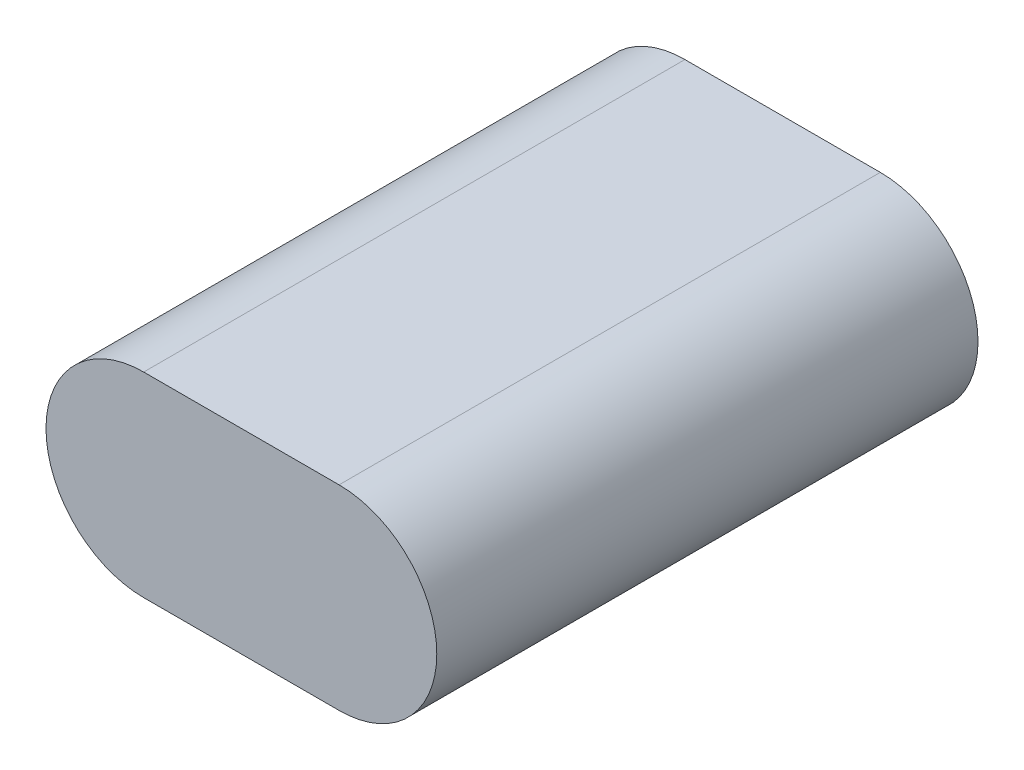
ISO-10303-21;
HEADER;
FILE_DESCRIPTION(('STEP AP214'),'2;1');
FILE_NAME('part.step','',(''),(''),'','','');
FILE_SCHEMA(('AUTOMOTIVE_DESIGN { 1 0 10303 214 1 1 1 1 }'));
ENDSEC;
DATA;
#1=APPLICATION_CONTEXT('core data for automotive mechanical design processes');
#2=APPLICATION_PROTOCOL_DEFINITION('international standard','automotive_design',2000,#1);
#3=PRODUCT_CONTEXT('',#1,'mechanical');
#4=PRODUCT('Part','Part','',(#3));
#5=PRODUCT_RELATED_PRODUCT_CATEGORY('part','',(#4));
#6=PRODUCT_DEFINITION_FORMATION('','',#4);
#7=PRODUCT_DEFINITION_CONTEXT('part definition',#1,'design');
#8=PRODUCT_DEFINITION('design','',#6,#7);
#9=PRODUCT_DEFINITION_SHAPE('','',#8);
#10=(LENGTH_UNIT() NAMED_UNIT(*) SI_UNIT(.MILLI.,.METRE.));
#11=(NAMED_UNIT(*) PLANE_ANGLE_UNIT() SI_UNIT($,.RADIAN.));
#12=(NAMED_UNIT(*) SI_UNIT($,.STERADIAN.) SOLID_ANGLE_UNIT());
#13=UNCERTAINTY_MEASURE_WITH_UNIT(LENGTH_MEASURE(1.E-05),#10,'distance_accuracy_value','');
#14=(GEOMETRIC_REPRESENTATION_CONTEXT(3) GLOBAL_UNCERTAINTY_ASSIGNED_CONTEXT((#13)) GLOBAL_UNIT_ASSIGNED_CONTEXT((#10,
#11,#12)) REPRESENTATION_CONTEXT('',''));
#15=CARTESIAN_POINT('',(0.,0.,0.));
#16=DIRECTION('',(0.,0.,1.));
#17=DIRECTION('',(1.,0.,0.));
#18=AXIS2_PLACEMENT_3D('',#15,#16,#17);
#19=CARTESIAN_POINT('',(50.,0.,138.5));
#20=DIRECTION('',(0.,0.,-1.));
#21=DIRECTION('',(-1.,0.,0.));
#22=AXIS2_PLACEMENT_3D('',#19,#20,#21);
#23=CYLINDRICAL_SURFACE('',#22,50.);
#24=CARTESIAN_POINT('',(50.,0.,-138.5));
#25=DIRECTION('',(0.,0.,1.));
#26=DIRECTION('',(-1.,0.,0.));
#27=AXIS2_PLACEMENT_3D('',#24,#25,#26);
#28=CIRCLE('',#27,50.);
#29=CARTESIAN_POINT('',(50.,-50.,-138.5));
#30=VERTEX_POINT('',#29);
#31=CARTESIAN_POINT('',(50.,50.,-138.5));
#32=VERTEX_POINT('',#31);
#33=EDGE_CURVE('E99',#30,#32,#28,.T.);
#34=ORIENTED_EDGE('',*,*,#33,.T.);
#35=DIRECTION('',(0.,0.,-1.));
#36=VECTOR('',#35,1.);
#37=CARTESIAN_POINT('',(50.,50.,138.5));
#38=LINE('',#37,#36);
#39=CARTESIAN_POINT('',(50.,50.,138.5));
#40=VERTEX_POINT('',#39);
#41=EDGE_CURVE('E11',#40,#32,#38,.T.);
#42=ORIENTED_EDGE('',*,*,#41,.F.);
#43=CARTESIAN_POINT('',(50.,0.,138.5));
#44=DIRECTION('',(0.,0.,1.));
#45=DIRECTION('',(-1.,0.,0.));
#46=AXIS2_PLACEMENT_3D('',#43,#44,#45);
#47=CIRCLE('',#46,50.);
#48=CARTESIAN_POINT('',(50.,-50.,138.5));
#49=VERTEX_POINT('',#48);
#50=EDGE_CURVE('E87',#49,#40,#47,.T.);
#51=ORIENTED_EDGE('',*,*,#50,.F.);
#52=DIRECTION('',(0.,0.,-1.));
#53=VECTOR('',#52,1.);
#54=CARTESIAN_POINT('',(50.,-50.,138.5));
#55=LINE('',#54,#53);
#56=EDGE_CURVE('E95',#49,#30,#55,.T.);
#57=ORIENTED_EDGE('',*,*,#56,.T.);
#58=EDGE_LOOP('',(#34,#42,#51,#57));
#59=FACE_BOUND('',#58,.T.);
#60=ADVANCED_FACE('F36',(#59),#23,.T.);
#61=CARTESIAN_POINT('',(-50.,50.,138.5));
#62=DIRECTION('',(0.,-1.,0.));
#63=DIRECTION('',(1.,0.,0.));
#64=AXIS2_PLACEMENT_3D('',#61,#62,#63);
#65=PLANE('',#64);
#66=DIRECTION('',(-1.,0.,0.));
#67=VECTOR('',#66,1.);
#68=CARTESIAN_POINT('',(-50.,50.,-138.5));
#69=LINE('',#68,#67);
#70=CARTESIAN_POINT('',(-50.,50.,-138.5));
#71=VERTEX_POINT('',#70);
#72=EDGE_CURVE('E91',#32,#71,#69,.T.);
#73=ORIENTED_EDGE('',*,*,#72,.T.);
#74=DIRECTION('',(0.,0.,-1.));
#75=VECTOR('',#74,1.);
#76=CARTESIAN_POINT('',(-50.,50.,138.5));
#77=LINE('',#76,#75);
#78=CARTESIAN_POINT('',(-50.,50.,138.5));
#79=VERTEX_POINT('',#78);
#80=EDGE_CURVE('E44',#79,#71,#77,.T.);
#81=ORIENTED_EDGE('',*,*,#80,.F.);
#82=DIRECTION('',(-1.,0.,0.));
#83=VECTOR('',#82,1.);
#84=CARTESIAN_POINT('',(-50.,50.,138.5));
#85=LINE('',#84,#83);
#86=EDGE_CURVE('E82',#40,#79,#85,.T.);
#87=ORIENTED_EDGE('',*,*,#86,.F.);
#88=ORIENTED_EDGE('',*,*,#41,.T.);
#89=EDGE_LOOP('',(#73,#81,#87,#88));
#90=FACE_BOUND('',#89,.T.);
#91=ADVANCED_FACE('F90',(#90),#65,.F.);
#92=CARTESIAN_POINT('',(-50.,0.,138.5));
#93=DIRECTION('',(0.,0.,-1.));
#94=DIRECTION('',(-1.,0.,0.));
#95=AXIS2_PLACEMENT_3D('',#92,#93,#94);
#96=CYLINDRICAL_SURFACE('',#95,50.);
#97=CARTESIAN_POINT('',(-50.,0.,-138.5));
#98=DIRECTION('',(0.,0.,1.));
#99=DIRECTION('',(1.,0.,0.));
#100=AXIS2_PLACEMENT_3D('',#97,#98,#99);
#101=CIRCLE('',#100,50.);
#102=CARTESIAN_POINT('',(-50.,-50.,-138.5));
#103=VERTEX_POINT('',#102);
#104=EDGE_CURVE('E69',#71,#103,#101,.T.);
#105=ORIENTED_EDGE('',*,*,#104,.T.);
#106=DIRECTION('',(0.,0.,-1.));
#107=VECTOR('',#106,1.);
#108=CARTESIAN_POINT('',(-50.,-50.,138.5));
#109=LINE('',#108,#107);
#110=CARTESIAN_POINT('',(-50.,-50.,138.5));
#111=VERTEX_POINT('',#110);
#112=EDGE_CURVE('E92',#111,#103,#109,.T.);
#113=ORIENTED_EDGE('',*,*,#112,.F.);
#114=CARTESIAN_POINT('',(-50.,0.,138.5));
#115=DIRECTION('',(0.,0.,1.));
#116=DIRECTION('',(1.,0.,0.));
#117=AXIS2_PLACEMENT_3D('',#114,#115,#116);
#118=CIRCLE('',#117,50.);
#119=EDGE_CURVE('E85',#79,#111,#118,.T.);
#120=ORIENTED_EDGE('',*,*,#119,.F.);
#121=ORIENTED_EDGE('',*,*,#80,.T.);
#122=EDGE_LOOP('',(#105,#113,#120,#121));
#123=FACE_BOUND('',#122,.T.);
#124=ADVANCED_FACE('F93',(#123),#96,.T.);
#125=CARTESIAN_POINT('',(-50.,-50.,138.5));
#126=DIRECTION('',(0.,1.,0.));
#127=DIRECTION('',(-1.,0.,0.));
#128=AXIS2_PLACEMENT_3D('',#125,#126,#127);
#129=PLANE('',#128);
#130=DIRECTION('',(1.,0.,0.));
#131=VECTOR('',#130,1.);
#132=CARTESIAN_POINT('',(-50.,-50.,-138.5));
#133=LINE('',#132,#131);
#134=EDGE_CURVE('E75',#103,#30,#133,.T.);
#135=ORIENTED_EDGE('',*,*,#134,.T.);
#136=ORIENTED_EDGE('',*,*,#56,.F.);
#137=DIRECTION('',(1.,0.,0.));
#138=VECTOR('',#137,1.);
#139=CARTESIAN_POINT('',(-50.,-50.,138.5));
#140=LINE('',#139,#138);
#141=EDGE_CURVE('E52',#111,#49,#140,.T.);
#142=ORIENTED_EDGE('',*,*,#141,.F.);
#143=ORIENTED_EDGE('',*,*,#112,.T.);
#144=EDGE_LOOP('',(#135,#136,#142,#143));
#145=FACE_BOUND('',#144,.T.);
#146=ADVANCED_FACE('F106',(#145),#129,.F.);
#147=CARTESIAN_POINT('',(50.,0.,138.5));
#148=DIRECTION('',(0.,0.,-1.));
#149=DIRECTION('',(-1.,0.,0.));
#150=AXIS2_PLACEMENT_3D('',#147,#148,#149);
#151=PLANE('',#150);
#152=ORIENTED_EDGE('',*,*,#50,.T.);
#153=ORIENTED_EDGE('',*,*,#86,.T.);
#154=ORIENTED_EDGE('',*,*,#119,.T.);
#155=ORIENTED_EDGE('',*,*,#141,.T.);
#156=EDGE_LOOP('',(#152,#153,#154,#155));
#157=FACE_BOUND('',#156,.T.);
#158=ADVANCED_FACE('F83',(#157),#151,.F.);
#159=CARTESIAN_POINT('',(50.,0.,-138.5));
#160=DIRECTION('',(0.,0.,-1.));
#161=DIRECTION('',(-1.,0.,0.));
#162=AXIS2_PLACEMENT_3D('',#159,#160,#161);
#163=PLANE('',#162);
#164=ORIENTED_EDGE('',*,*,#33,.F.);
#165=ORIENTED_EDGE('',*,*,#134,.F.);
#166=ORIENTED_EDGE('',*,*,#104,.F.);
#167=ORIENTED_EDGE('',*,*,#72,.F.);
#168=EDGE_LOOP('',(#164,#165,#166,#167));
#169=FACE_BOUND('',#168,.T.);
#170=ADVANCED_FACE('F109',(#169),#163,.T.);
#171=CLOSED_SHELL('',(#60,#91,#124,#146,#158,#170));
#172=MANIFOLD_SOLID_BREP('B2',#171);
#173=ADVANCED_BREP_SHAPE_REPRESENTATION('',(#18,#172),#14);
#174=SHAPE_DEFINITION_REPRESENTATION(#9,#173);
ENDSEC;
END-ISO-10303-21;
